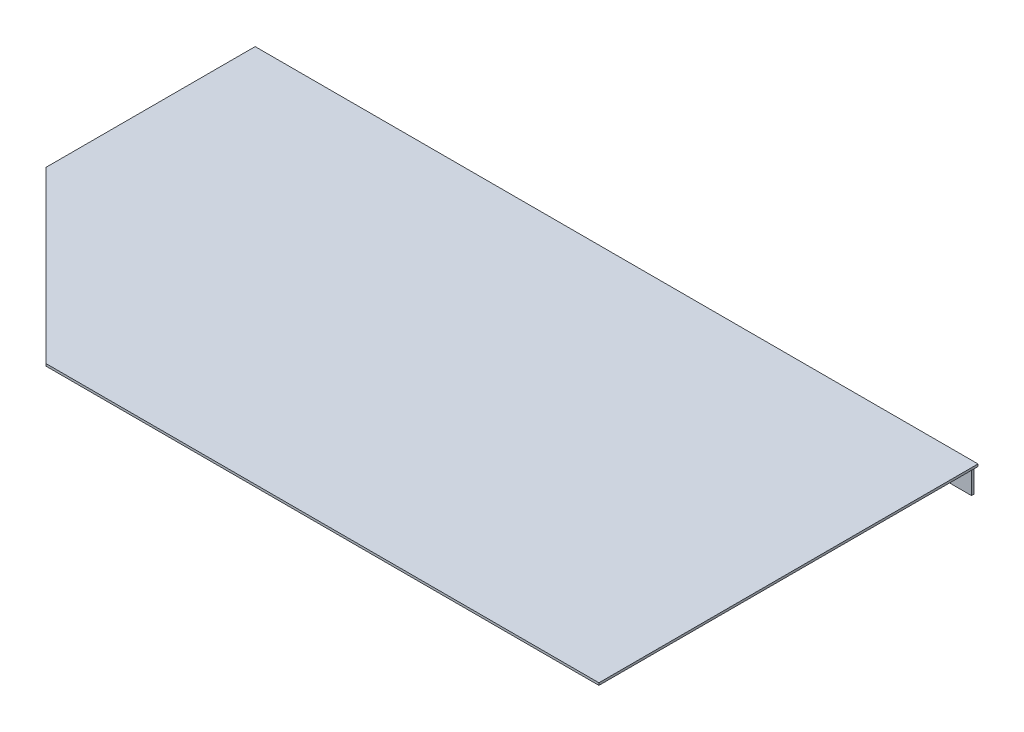
ISO-10303-21;
HEADER;
FILE_DESCRIPTION(('STEP AP214'),'2;1');
FILE_NAME('part.step','',(''),(''),'','','');
FILE_SCHEMA(('AUTOMOTIVE_DESIGN { 1 0 10303 214 1 1 1 1 }'));
ENDSEC;
DATA;
#1=APPLICATION_CONTEXT('core data for automotive mechanical design processes');
#2=APPLICATION_PROTOCOL_DEFINITION('international standard','automotive_design',2000,#1);
#3=PRODUCT_CONTEXT('',#1,'mechanical');
#4=PRODUCT('Part','Part','',(#3));
#5=PRODUCT_RELATED_PRODUCT_CATEGORY('part','',(#4));
#6=PRODUCT_DEFINITION_FORMATION('','',#4);
#7=PRODUCT_DEFINITION_CONTEXT('part definition',#1,'design');
#8=PRODUCT_DEFINITION('design','',#6,#7);
#9=PRODUCT_DEFINITION_SHAPE('','',#8);
#10=(LENGTH_UNIT() NAMED_UNIT(*) SI_UNIT(.MILLI.,.METRE.));
#11=(NAMED_UNIT(*) PLANE_ANGLE_UNIT() SI_UNIT($,.RADIAN.));
#12=(NAMED_UNIT(*) SI_UNIT($,.STERADIAN.) SOLID_ANGLE_UNIT());
#13=UNCERTAINTY_MEASURE_WITH_UNIT(LENGTH_MEASURE(1.E-05),#10,'distance_accuracy_value','');
#14=(GEOMETRIC_REPRESENTATION_CONTEXT(3) GLOBAL_UNCERTAINTY_ASSIGNED_CONTEXT((#13)) GLOBAL_UNIT_ASSIGNED_CONTEXT((#10,
#11,#12)) REPRESENTATION_CONTEXT('',''));
#15=CARTESIAN_POINT('',(0.,0.,0.));
#16=DIRECTION('',(0.,0.,1.));
#17=DIRECTION('',(1.,0.,0.));
#18=AXIS2_PLACEMENT_3D('',#15,#16,#17);
#19=CARTESIAN_POINT('',(276.5,-1.75,290.));
#20=DIRECTION('',(0.,1.,0.));
#21=DIRECTION('',(-1.,0.,0.));
#22=AXIS2_PLACEMENT_3D('',#19,#20,#21);
#23=PLANE('',#22);
#24=DIRECTION('',(0.,0.,1.));
#25=VECTOR('',#24,1.);
#26=CARTESIAN_POINT('',(273.25,-1.75,0.));
#27=LINE('',#26,#25);
#28=CARTESIAN_POINT('',(273.25,-1.75,0.));
#29=VERTEX_POINT('',#28);
#30=CARTESIAN_POINT('',(273.25,-1.75,1.75000000000007));
#31=VERTEX_POINT('',#30);
#32=EDGE_CURVE('E122',#29,#31,#27,.T.);
#33=ORIENTED_EDGE('',*,*,#32,.F.);
#34=DIRECTION('',(1.,0.,0.));
#35=VECTOR('',#34,1.);
#36=CARTESIAN_POINT('',(276.5,-1.75,0.));
#37=LINE('',#36,#35);
#38=CARTESIAN_POINT('',(276.5,-1.75,0.));
#39=VERTEX_POINT('',#38);
#40=EDGE_CURVE('E138',#29,#39,#37,.T.);
#41=ORIENTED_EDGE('',*,*,#40,.T.);
#42=DIRECTION('',(0.,0.,-1.));
#43=VECTOR('',#42,1.);
#44=CARTESIAN_POINT('',(276.5,-1.75,290.));
#45=LINE('',#44,#43);
#46=CARTESIAN_POINT('',(276.5,-1.75,290.));
#47=VERTEX_POINT('',#46);
#48=EDGE_CURVE('E43',#47,#39,#45,.T.);
#49=ORIENTED_EDGE('',*,*,#48,.F.);
#50=DIRECTION('',(1.,0.,0.));
#51=VECTOR('',#50,1.);
#52=CARTESIAN_POINT('',(276.5,-1.75,290.));
#53=LINE('',#52,#51);
#54=CARTESIAN_POINT('',(-146.5,-1.75000000000005,290.));
#55=VERTEX_POINT('',#54);
#56=EDGE_CURVE('E139',#55,#47,#53,.T.);
#57=ORIENTED_EDGE('',*,*,#56,.F.);
#58=DIRECTION('',(-0.707106781186546,0.,-0.707106781186549));
#59=VECTOR('',#58,1.);
#60=CARTESIAN_POINT('',(64.9999999999991,-1.75000000000003,501.5));
#61=LINE('',#60,#59);
#62=CARTESIAN_POINT('',(-276.5,-1.75000000000007,160.));
#63=VERTEX_POINT('',#62);
#64=EDGE_CURVE('E135',#55,#63,#61,.T.);
#65=ORIENTED_EDGE('',*,*,#64,.T.);
#66=DIRECTION('',(0.,0.,-1.));
#67=VECTOR('',#66,1.);
#68=CARTESIAN_POINT('',(-276.5,-1.75000000000007,290.));
#69=LINE('',#68,#67);
#70=CARTESIAN_POINT('',(-276.5,-1.75000000000007,0.));
#71=VERTEX_POINT('',#70);
#72=EDGE_CURVE('E147',#63,#71,#69,.T.);
#73=ORIENTED_EDGE('',*,*,#72,.T.);
#74=CARTESIAN_POINT('',(-274.75,-1.75000000000007,0.));
#75=VERTEX_POINT('',#74);
#76=EDGE_CURVE('E148',#71,#75,#37,.T.);
#77=ORIENTED_EDGE('',*,*,#76,.T.);
#78=DIRECTION('',(0.,0.,-1.));
#79=VECTOR('',#78,1.);
#80=CARTESIAN_POINT('',(-274.75,-1.75000000000007,1.75));
#81=LINE('',#80,#79);
#82=CARTESIAN_POINT('',(-274.75,-1.75000000000007,1.75));
#83=VERTEX_POINT('',#82);
#84=EDGE_CURVE('E55',#83,#75,#81,.T.);
#85=ORIENTED_EDGE('',*,*,#84,.F.);
#86=DIRECTION('',(-1.,0.,0.));
#87=VECTOR('',#86,1.);
#88=CARTESIAN_POINT('',(273.25,-1.75,1.75000000000007));
#89=LINE('',#88,#87);
#90=EDGE_CURVE('E50',#31,#83,#89,.T.);
#91=ORIENTED_EDGE('',*,*,#90,.F.);
#92=EDGE_LOOP('',(#33,#41,#49,#57,#65,#73,#77,#85,#91));
#93=FACE_BOUND('',#92,.T.);
#94=ADVANCED_FACE('F36',(#93),#23,.F.);
#95=CARTESIAN_POINT('',(276.5,1.01584451989273E-13,290.));
#96=DIRECTION('',(-1.,0.,0.));
#97=DIRECTION('',(0.,0.,1.));
#98=AXIS2_PLACEMENT_3D('',#95,#96,#97);
#99=PLANE('',#98);
#100=DIRECTION('',(0.,1.,0.));
#101=VECTOR('',#100,1.);
#102=CARTESIAN_POINT('',(276.5,1.01584451989273E-13,0.));
#103=LINE('',#102,#101);
#104=CARTESIAN_POINT('',(276.5,1.01584451989273E-13,0.));
#105=VERTEX_POINT('',#104);
#106=EDGE_CURVE('E150',#39,#105,#103,.T.);
#107=ORIENTED_EDGE('',*,*,#106,.T.);
#108=DIRECTION('',(0.,0.,-1.));
#109=VECTOR('',#108,1.);
#110=CARTESIAN_POINT('',(276.5,1.01584451989273E-13,290.));
#111=LINE('',#110,#109);
#112=CARTESIAN_POINT('',(276.5,1.01584451989273E-13,290.));
#113=VERTEX_POINT('',#112);
#114=EDGE_CURVE('E160',#113,#105,#111,.T.);
#115=ORIENTED_EDGE('',*,*,#114,.F.);
#116=DIRECTION('',(0.,1.,0.));
#117=VECTOR('',#116,1.);
#118=CARTESIAN_POINT('',(276.5,1.01584451989273E-13,290.));
#119=LINE('',#118,#117);
#120=EDGE_CURVE('E141',#47,#113,#119,.T.);
#121=ORIENTED_EDGE('',*,*,#120,.F.);
#122=ORIENTED_EDGE('',*,*,#48,.T.);
#123=EDGE_LOOP('',(#107,#115,#121,#122));
#124=FACE_BOUND('',#123,.T.);
#125=ADVANCED_FACE('F166',(#124),#99,.F.);
#126=CARTESIAN_POINT('',(-276.5,0.,290.));
#127=DIRECTION('',(0.,-1.,0.));
#128=DIRECTION('',(1.,0.,0.));
#129=AXIS2_PLACEMENT_3D('',#126,#127,#128);
#130=PLANE('',#129);
#131=DIRECTION('',(0.,0.,-1.));
#132=VECTOR('',#131,1.);
#133=CARTESIAN_POINT('',(-276.5,0.,290.));
#134=LINE('',#133,#132);
#135=CARTESIAN_POINT('',(-276.5,0.,160.));
#136=VERTEX_POINT('',#135);
#137=CARTESIAN_POINT('',(-276.5,0.,0.));
#138=VERTEX_POINT('',#137);
#139=EDGE_CURVE('E158',#136,#138,#134,.T.);
#140=ORIENTED_EDGE('',*,*,#139,.F.);
#141=DIRECTION('',(-0.707106781186546,0.,-0.707106781186549));
#142=VECTOR('',#141,1.);
#143=CARTESIAN_POINT('',(-276.5,0.,160.));
#144=LINE('',#143,#142);
#145=CARTESIAN_POINT('',(-146.5,0.,290.));
#146=VERTEX_POINT('',#145);
#147=EDGE_CURVE('E125',#146,#136,#144,.T.);
#148=ORIENTED_EDGE('',*,*,#147,.F.);
#149=DIRECTION('',(-1.,0.,0.));
#150=VECTOR('',#149,1.);
#151=CARTESIAN_POINT('',(-276.5,0.,290.));
#152=LINE('',#151,#150);
#153=EDGE_CURVE('E144',#113,#146,#152,.T.);
#154=ORIENTED_EDGE('',*,*,#153,.F.);
#155=ORIENTED_EDGE('',*,*,#114,.T.);
#156=DIRECTION('',(-1.,0.,0.));
#157=VECTOR('',#156,1.);
#158=CARTESIAN_POINT('',(-276.5,0.,0.));
#159=LINE('',#158,#157);
#160=EDGE_CURVE('E152',#105,#138,#159,.T.);
#161=ORIENTED_EDGE('',*,*,#160,.T.);
#162=EDGE_LOOP('',(#140,#148,#154,#155,#161));
#163=FACE_BOUND('',#162,.T.);
#164=ADVANCED_FACE('F180',(#163),#130,.F.);
#165=CARTESIAN_POINT('',(-276.5,0.,290.));
#166=DIRECTION('',(1.,0.,0.));
#167=DIRECTION('',(0.,0.,-1.));
#168=AXIS2_PLACEMENT_3D('',#165,#166,#167);
#169=PLANE('',#168);
#170=ORIENTED_EDGE('',*,*,#72,.F.);
#171=DIRECTION('',(0.,1.,0.));
#172=VECTOR('',#171,1.);
#173=CARTESIAN_POINT('',(-276.5,-10.,160.));
#174=LINE('',#173,#172);
#175=EDGE_CURVE('E127',#63,#136,#174,.T.);
#176=ORIENTED_EDGE('',*,*,#175,.T.);
#177=ORIENTED_EDGE('',*,*,#139,.T.);
#178=DIRECTION('',(0.,-1.,0.));
#179=VECTOR('',#178,1.);
#180=CARTESIAN_POINT('',(-276.5,0.,0.));
#181=LINE('',#180,#179);
#182=EDGE_CURVE('E142',#138,#71,#181,.T.);
#183=ORIENTED_EDGE('',*,*,#182,.T.);
#184=EDGE_LOOP('',(#170,#176,#177,#183));
#185=FACE_BOUND('',#184,.T.);
#186=ADVANCED_FACE('F190',(#185),#169,.F.);
#187=CARTESIAN_POINT('',(0.,0.,290.));
#188=DIRECTION('',(0.,0.,1.));
#189=DIRECTION('',(1.,0.,0.));
#190=AXIS2_PLACEMENT_3D('',#187,#188,#189);
#191=PLANE('',#190);
#192=DIRECTION('',(0.,1.,0.));
#193=VECTOR('',#192,1.);
#194=CARTESIAN_POINT('',(-146.5,0.,290.));
#195=LINE('',#194,#193);
#196=EDGE_CURVE('E11',#55,#146,#195,.T.);
#197=ORIENTED_EDGE('',*,*,#196,.F.);
#198=ORIENTED_EDGE('',*,*,#56,.T.);
#199=ORIENTED_EDGE('',*,*,#120,.T.);
#200=ORIENTED_EDGE('',*,*,#153,.T.);
#201=EDGE_LOOP('',(#197,#198,#199,#200));
#202=FACE_BOUND('',#201,.T.);
#203=ADVANCED_FACE('F185',(#202),#191,.T.);
#204=CARTESIAN_POINT('',(0.,0.,0.));
#205=DIRECTION('',(0.,0.,1.));
#206=DIRECTION('',(1.,0.,0.));
#207=AXIS2_PLACEMENT_3D('',#204,#205,#206);
#208=PLANE('',#207);
#209=ORIENTED_EDGE('',*,*,#76,.F.);
#210=ORIENTED_EDGE('',*,*,#182,.F.);
#211=ORIENTED_EDGE('',*,*,#160,.F.);
#212=ORIENTED_EDGE('',*,*,#106,.F.);
#213=ORIENTED_EDGE('',*,*,#40,.F.);
#214=DIRECTION('',(0.,1.,0.));
#215=VECTOR('',#214,1.);
#216=CARTESIAN_POINT('',(273.25,-21.75,0.));
#217=LINE('',#216,#215);
#218=CARTESIAN_POINT('',(273.25,-21.75,0.));
#219=VERTEX_POINT('',#218);
#220=EDGE_CURVE('E129',#219,#29,#217,.T.);
#221=ORIENTED_EDGE('',*,*,#220,.F.);
#222=DIRECTION('',(1.,0.,0.));
#223=VECTOR('',#222,1.);
#224=CARTESIAN_POINT('',(-274.75,-21.7500000000001,0.));
#225=LINE('',#224,#223);
#226=CARTESIAN_POINT('',(-274.75,-21.7500000000001,0.));
#227=VERTEX_POINT('',#226);
#228=EDGE_CURVE('E112',#227,#219,#225,.T.);
#229=ORIENTED_EDGE('',*,*,#228,.F.);
#230=DIRECTION('',(0.,1.,0.));
#231=VECTOR('',#230,1.);
#232=CARTESIAN_POINT('',(-274.75,-21.7500000000001,0.));
#233=LINE('',#232,#231);
#234=EDGE_CURVE('E109',#227,#75,#233,.T.);
#235=ORIENTED_EDGE('',*,*,#234,.T.);
#236=EDGE_LOOP('',(#209,#210,#211,#212,#213,#221,#229,#235));
#237=FACE_BOUND('',#236,.T.);
#238=ADVANCED_FACE('F176',(#237),#208,.F.);
#239=CARTESIAN_POINT('',(-276.5,-10.,160.));
#240=DIRECTION('',(0.707106781186549,0.,-0.707106781186546));
#241=DIRECTION('',(-0.707106781186546,0.,-0.707106781186549));
#242=AXIS2_PLACEMENT_3D('',#239,#240,#241);
#243=PLANE('',#242);
#244=ORIENTED_EDGE('',*,*,#196,.T.);
#245=ORIENTED_EDGE('',*,*,#147,.T.);
#246=ORIENTED_EDGE('',*,*,#175,.F.);
#247=ORIENTED_EDGE('',*,*,#64,.F.);
#248=EDGE_LOOP('',(#244,#245,#246,#247));
#249=FACE_BOUND('',#248,.T.);
#250=ADVANCED_FACE('F187',(#249),#243,.F.);
#251=CARTESIAN_POINT('',(273.25,-21.75,1.75000000000007));
#252=DIRECTION('',(0.,0.,-1.));
#253=DIRECTION('',(-1.,0.,0.));
#254=AXIS2_PLACEMENT_3D('',#251,#252,#253);
#255=PLANE('',#254);
#256=ORIENTED_EDGE('',*,*,#90,.T.);
#257=DIRECTION('',(0.,1.,0.));
#258=VECTOR('',#257,1.);
#259=CARTESIAN_POINT('',(-274.75,-21.7500000000001,1.75));
#260=LINE('',#259,#258);
#261=CARTESIAN_POINT('',(-274.75,-21.7500000000001,1.75));
#262=VERTEX_POINT('',#261);
#263=EDGE_CURVE('E107',#262,#83,#260,.T.);
#264=ORIENTED_EDGE('',*,*,#263,.F.);
#265=DIRECTION('',(-1.,0.,0.));
#266=VECTOR('',#265,1.);
#267=CARTESIAN_POINT('',(273.25,-21.75,1.75000000000007));
#268=LINE('',#267,#266);
#269=CARTESIAN_POINT('',(273.25,-21.75,1.75000000000007));
#270=VERTEX_POINT('',#269);
#271=EDGE_CURVE('E113',#270,#262,#268,.T.);
#272=ORIENTED_EDGE('',*,*,#271,.F.);
#273=DIRECTION('',(0.,1.,0.));
#274=VECTOR('',#273,1.);
#275=CARTESIAN_POINT('',(273.25,-21.75,1.75000000000007));
#276=LINE('',#275,#274);
#277=EDGE_CURVE('E196',#270,#31,#276,.T.);
#278=ORIENTED_EDGE('',*,*,#277,.T.);
#279=EDGE_LOOP('',(#256,#264,#272,#278));
#280=FACE_BOUND('',#279,.T.);
#281=ADVANCED_FACE('F124',(#280),#255,.F.);
#282=CARTESIAN_POINT('',(-274.75,-21.7500000000001,1.75));
#283=DIRECTION('',(1.,0.,0.));
#284=DIRECTION('',(0.,1.,0.));
#285=AXIS2_PLACEMENT_3D('',#282,#283,#284);
#286=PLANE('',#285);
#287=ORIENTED_EDGE('',*,*,#84,.T.);
#288=ORIENTED_EDGE('',*,*,#234,.F.);
#289=DIRECTION('',(0.,0.,-1.));
#290=VECTOR('',#289,1.);
#291=CARTESIAN_POINT('',(-274.75,-21.7500000000001,1.75));
#292=LINE('',#291,#290);
#293=EDGE_CURVE('E103',#262,#227,#292,.T.);
#294=ORIENTED_EDGE('',*,*,#293,.F.);
#295=ORIENTED_EDGE('',*,*,#263,.T.);
#296=EDGE_LOOP('',(#287,#288,#294,#295));
#297=FACE_BOUND('',#296,.T.);
#298=ADVANCED_FACE('F105',(#297),#286,.F.);
#299=CARTESIAN_POINT('',(273.25,-21.75,0.));
#300=DIRECTION('',(-1.,0.,0.));
#301=DIRECTION('',(0.,-1.,0.));
#302=AXIS2_PLACEMENT_3D('',#299,#300,#301);
#303=PLANE('',#302);
#304=ORIENTED_EDGE('',*,*,#32,.T.);
#305=ORIENTED_EDGE('',*,*,#277,.F.);
#306=DIRECTION('',(0.,0.,1.));
#307=VECTOR('',#306,1.);
#308=CARTESIAN_POINT('',(273.25,-21.75,0.));
#309=LINE('',#308,#307);
#310=EDGE_CURVE('E118',#219,#270,#309,.T.);
#311=ORIENTED_EDGE('',*,*,#310,.F.);
#312=ORIENTED_EDGE('',*,*,#220,.T.);
#313=EDGE_LOOP('',(#304,#305,#311,#312));
#314=FACE_BOUND('',#313,.T.);
#315=ADVANCED_FACE('F198',(#314),#303,.F.);
#316=CARTESIAN_POINT('',(0.,-21.75,0.));
#317=DIRECTION('',(0.,-1.,0.));
#318=DIRECTION('',(1.,0.,0.));
#319=AXIS2_PLACEMENT_3D('',#316,#317,#318);
#320=PLANE('',#319);
#321=ORIENTED_EDGE('',*,*,#271,.T.);
#322=ORIENTED_EDGE('',*,*,#293,.T.);
#323=ORIENTED_EDGE('',*,*,#228,.T.);
#324=ORIENTED_EDGE('',*,*,#310,.T.);
#325=EDGE_LOOP('',(#321,#322,#323,#324));
#326=FACE_BOUND('',#325,.T.);
#327=ADVANCED_FACE('F116',(#326),#320,.T.);
#328=CLOSED_SHELL('',(#94,#125,#164,#186,#203,#238,#250,#281,#298,#315,#327));
#329=MANIFOLD_SOLID_BREP('B2',#328);
#330=ADVANCED_BREP_SHAPE_REPRESENTATION('',(#18,#329),#14);
#331=SHAPE_DEFINITION_REPRESENTATION(#9,#330);
ENDSEC;
END-ISO-10303-21;
